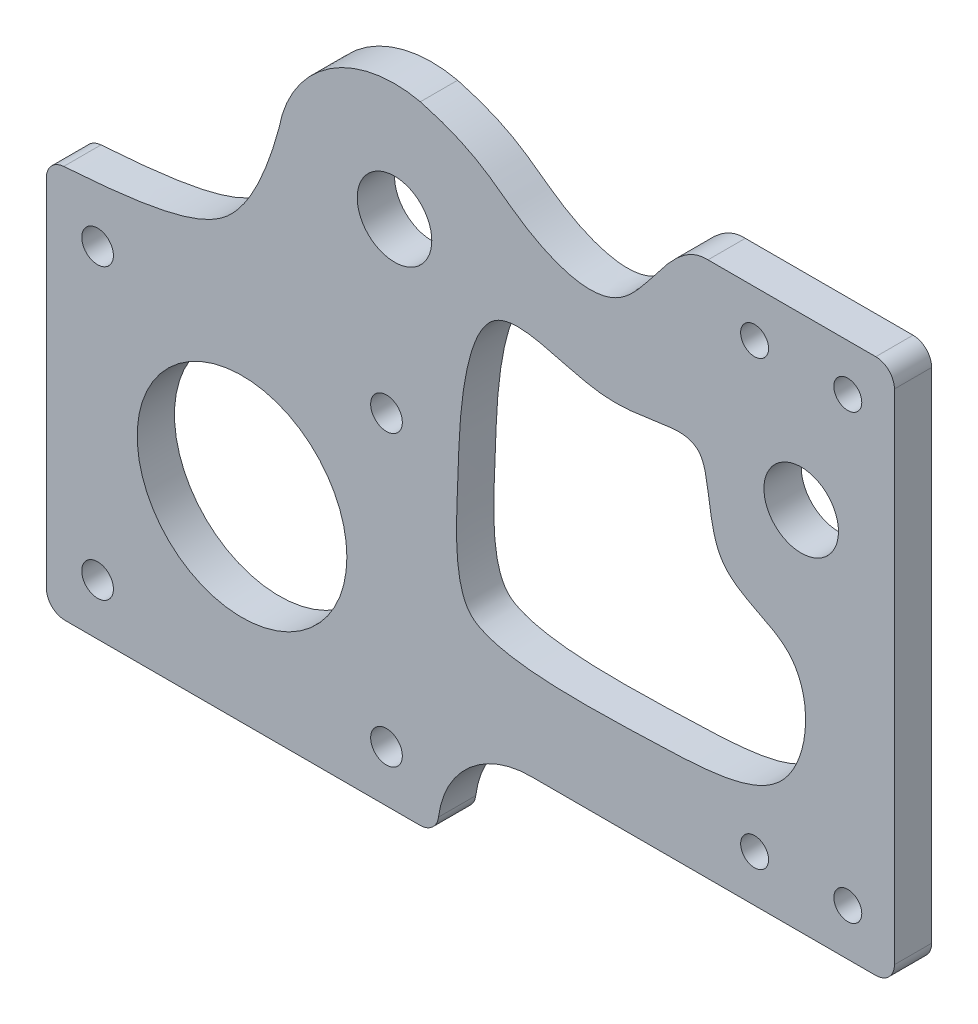
ISO-10303-21;
HEADER;
FILE_DESCRIPTION(('STEP AP214'),'2;1');
FILE_NAME('part.step','',(''),(''),'','','');
FILE_SCHEMA(('AUTOMOTIVE_DESIGN { 1 0 10303 214 1 1 1 1 }'));
ENDSEC;
DATA;
#1=APPLICATION_CONTEXT('core data for automotive mechanical design processes');
#2=APPLICATION_PROTOCOL_DEFINITION('international standard','automotive_design',2000,#1);
#3=PRODUCT_CONTEXT('',#1,'mechanical');
#4=PRODUCT('Part','Part','',(#3));
#5=PRODUCT_RELATED_PRODUCT_CATEGORY('part','',(#4));
#6=PRODUCT_DEFINITION_FORMATION('','',#4);
#7=PRODUCT_DEFINITION_CONTEXT('part definition',#1,'design');
#8=PRODUCT_DEFINITION('design','',#6,#7);
#9=PRODUCT_DEFINITION_SHAPE('','',#8);
#10=(LENGTH_UNIT() NAMED_UNIT(*) SI_UNIT(.MILLI.,.METRE.));
#11=(NAMED_UNIT(*) PLANE_ANGLE_UNIT() SI_UNIT($,.RADIAN.));
#12=(NAMED_UNIT(*) SI_UNIT($,.STERADIAN.) SOLID_ANGLE_UNIT());
#13=UNCERTAINTY_MEASURE_WITH_UNIT(LENGTH_MEASURE(1.E-05),#10,'distance_accuracy_value','');
#14=(GEOMETRIC_REPRESENTATION_CONTEXT(3) GLOBAL_UNCERTAINTY_ASSIGNED_CONTEXT((#13)) GLOBAL_UNIT_ASSIGNED_CONTEXT((#10,
#11,#12)) REPRESENTATION_CONTEXT('',''));
#15=CARTESIAN_POINT('',(0.,0.,0.));
#16=DIRECTION('',(0.,0.,1.));
#17=DIRECTION('',(1.,0.,0.));
#18=AXIS2_PLACEMENT_3D('',#15,#16,#17);
#19=CARTESIAN_POINT('',(-81.,0.,4.));
#20=DIRECTION('',(-1.,0.,0.));
#21=DIRECTION('',(0.,0.,1.));
#22=AXIS2_PLACEMENT_3D('',#19,#20,#21);
#23=PLANE('',#22);
#24=DIRECTION('',(0.,1.,0.));
#25=VECTOR('',#24,1.);
#26=CARTESIAN_POINT('',(-81.,0.,4.));
#27=LINE('',#26,#25);
#28=CARTESIAN_POINT('',(-81.,-47.75,4.));
#29=VERTEX_POINT('',#28);
#30=CARTESIAN_POINT('',(-81.,-9.62963183008872,4.));
#31=VERTEX_POINT('',#30);
#32=EDGE_CURVE('E372',#29,#31,#27,.T.);
#33=ORIENTED_EDGE('',*,*,#32,.T.);
#34=DIRECTION('',(0.,0.,-1.));
#35=VECTOR('',#34,1.);
#36=CARTESIAN_POINT('',(-81.,-9.62963183008872,4.));
#37=LINE('',#36,#35);
#38=CARTESIAN_POINT('',(-81.,-9.62963183008872,0.));
#39=VERTEX_POINT('',#38);
#40=EDGE_CURVE('E267',#31,#39,#37,.T.);
#41=ORIENTED_EDGE('',*,*,#40,.T.);
#42=DIRECTION('',(0.,1.,0.));
#43=VECTOR('',#42,1.);
#44=CARTESIAN_POINT('',(-81.,0.,0.));
#45=LINE('',#44,#43);
#46=CARTESIAN_POINT('',(-81.,-47.75,0.));
#47=VERTEX_POINT('',#46);
#48=EDGE_CURVE('E287',#47,#39,#45,.T.);
#49=ORIENTED_EDGE('',*,*,#48,.F.);
#50=DIRECTION('',(0.,0.,-1.));
#51=VECTOR('',#50,1.);
#52=CARTESIAN_POINT('',(-81.,-47.75,4.));
#53=LINE('',#52,#51);
#54=EDGE_CURVE('E265',#47,#29,#53,.F.);
#55=ORIENTED_EDGE('',*,*,#54,.T.);
#56=EDGE_LOOP('',(#33,#41,#49,#55));
#57=FACE_BOUND('',#56,.T.);
#58=ADVANCED_FACE('F34',(#57),#23,.T.);
#59=CARTESIAN_POINT('',(0.,-49.75,4.));
#60=DIRECTION('',(0.,-1.,0.));
#61=DIRECTION('',(1.,0.,0.));
#62=AXIS2_PLACEMENT_3D('',#59,#60,#61);
#63=PLANE('',#62);
#64=DIRECTION('',(-1.,0.,0.));
#65=VECTOR('',#64,1.);
#66=CARTESIAN_POINT('',(0.,-49.75,0.));
#67=LINE('',#66,#65);
#68=CARTESIAN_POINT('',(-40.9058808997906,-49.75,0.));
#69=VERTEX_POINT('',#68);
#70=CARTESIAN_POINT('',(-79.,-49.75,0.));
#71=VERTEX_POINT('',#70);
#72=EDGE_CURVE('E276',#69,#71,#67,.T.);
#73=ORIENTED_EDGE('',*,*,#72,.F.);
#74=DIRECTION('',(0.,0.,-1.));
#75=VECTOR('',#74,1.);
#76=CARTESIAN_POINT('',(-40.9058808997906,-49.75,4.));
#77=LINE('',#76,#75);
#78=CARTESIAN_POINT('',(-40.9058808997906,-49.75,4.));
#79=VERTEX_POINT('',#78);
#80=EDGE_CURVE('E11',#69,#79,#77,.F.);
#81=ORIENTED_EDGE('',*,*,#80,.T.);
#82=DIRECTION('',(-1.,0.,0.));
#83=VECTOR('',#82,1.);
#84=CARTESIAN_POINT('',(0.,-49.75,4.));
#85=LINE('',#84,#83);
#86=CARTESIAN_POINT('',(-79.,-49.75,4.));
#87=VERTEX_POINT('',#86);
#88=EDGE_CURVE('E277',#79,#87,#85,.T.);
#89=ORIENTED_EDGE('',*,*,#88,.T.);
#90=DIRECTION('',(0.,0.,-1.));
#91=VECTOR('',#90,1.);
#92=CARTESIAN_POINT('',(-79.,-49.75,4.));
#93=LINE('',#92,#91);
#94=EDGE_CURVE('E42',#87,#71,#93,.T.);
#95=ORIENTED_EDGE('',*,*,#94,.T.);
#96=EDGE_LOOP('',(#73,#81,#89,#95));
#97=FACE_BOUND('',#96,.T.);
#98=ADVANCED_FACE('F192',(#97),#63,.T.);
#99=CARTESIAN_POINT('',(0.,-39.25,4.));
#100=DIRECTION('',(0.,1.,0.));
#101=DIRECTION('',(0.,0.,1.));
#102=AXIS2_PLACEMENT_3D('',#99,#100,#101);
#103=PLANE('',#102);
#104=DIRECTION('',(1.,0.,0.));
#105=VECTOR('',#104,1.);
#106=CARTESIAN_POINT('',(0.,-39.25,0.));
#107=LINE('',#106,#105);
#108=CARTESIAN_POINT('',(-29.,-39.25,0.));
#109=VERTEX_POINT('',#108);
#110=CARTESIAN_POINT('',(8.,-39.25,0.));
#111=VERTEX_POINT('',#110);
#112=EDGE_CURVE('E286',#109,#111,#107,.T.);
#113=ORIENTED_EDGE('',*,*,#112,.T.);
#114=DIRECTION('',(0.,0.,-1.));
#115=VECTOR('',#114,1.);
#116=CARTESIAN_POINT('',(8.,-39.25,4.));
#117=LINE('',#116,#115);
#118=CARTESIAN_POINT('',(8.,-39.25,4.));
#119=VERTEX_POINT('',#118);
#120=EDGE_CURVE('E57',#111,#119,#117,.F.);
#121=ORIENTED_EDGE('',*,*,#120,.T.);
#122=DIRECTION('',(1.,0.,0.));
#123=VECTOR('',#122,1.);
#124=CARTESIAN_POINT('',(0.,-39.25,4.));
#125=LINE('',#124,#123);
#126=CARTESIAN_POINT('',(-29.,-39.25,4.));
#127=VERTEX_POINT('',#126);
#128=EDGE_CURVE('E362',#127,#119,#125,.T.);
#129=ORIENTED_EDGE('',*,*,#128,.F.);
#130=DIRECTION('',(0.,0.,-1.));
#131=VECTOR('',#130,1.);
#132=CARTESIAN_POINT('',(-29.,-39.25,0.));
#133=LINE('',#132,#131);
#134=EDGE_CURVE('E160',#127,#109,#133,.T.);
#135=ORIENTED_EDGE('',*,*,#134,.T.);
#136=EDGE_LOOP('',(#113,#121,#129,#135));
#137=FACE_BOUND('',#136,.T.);
#138=ADVANCED_FACE('F188',(#137),#103,.F.);
#139=CARTESIAN_POINT('',(10.,0.,4.));
#140=DIRECTION('',(-1.,0.,0.));
#141=DIRECTION('',(0.,-1.,0.));
#142=AXIS2_PLACEMENT_3D('',#139,#140,#141);
#143=PLANE('',#142);
#144=DIRECTION('',(0.,1.,0.));
#145=VECTOR('',#144,1.);
#146=CARTESIAN_POINT('',(10.,0.,0.));
#147=LINE('',#146,#145);
#148=CARTESIAN_POINT('',(10.,-37.25,0.));
#149=VERTEX_POINT('',#148);
#150=CARTESIAN_POINT('',(10.,16.25,0.));
#151=VERTEX_POINT('',#150);
#152=EDGE_CURVE('E289',#149,#151,#147,.T.);
#153=ORIENTED_EDGE('',*,*,#152,.T.);
#154=DIRECTION('',(0.,0.,-1.));
#155=VECTOR('',#154,1.);
#156=CARTESIAN_POINT('',(10.,16.25,4.));
#157=LINE('',#156,#155);
#158=CARTESIAN_POINT('',(10.,16.25,4.));
#159=VERTEX_POINT('',#158);
#160=EDGE_CURVE('E258',#151,#159,#157,.F.);
#161=ORIENTED_EDGE('',*,*,#160,.T.);
#162=DIRECTION('',(0.,1.,0.));
#163=VECTOR('',#162,1.);
#164=CARTESIAN_POINT('',(10.,0.,4.));
#165=LINE('',#164,#163);
#166=CARTESIAN_POINT('',(10.,-37.25,4.));
#167=VERTEX_POINT('',#166);
#168=EDGE_CURVE('E150',#167,#159,#165,.T.);
#169=ORIENTED_EDGE('',*,*,#168,.F.);
#170=DIRECTION('',(0.,0.,-1.));
#171=VECTOR('',#170,1.);
#172=CARTESIAN_POINT('',(10.,-37.25,4.));
#173=LINE('',#172,#171);
#174=EDGE_CURVE('E355',#167,#149,#173,.T.);
#175=ORIENTED_EDGE('',*,*,#174,.T.);
#176=EDGE_LOOP('',(#153,#161,#169,#175));
#177=FACE_BOUND('',#176,.T.);
#178=ADVANCED_FACE('F185',(#177),#143,.F.);
#179=CARTESIAN_POINT('',(0.,18.25,4.));
#180=DIRECTION('',(0.,-1.,0.));
#181=DIRECTION('',(1.,0.,0.));
#182=AXIS2_PLACEMENT_3D('',#179,#180,#181);
#183=PLANE('',#182);
#184=DIRECTION('',(-1.,0.,0.));
#185=VECTOR('',#184,1.);
#186=CARTESIAN_POINT('',(0.,18.25,4.));
#187=LINE('',#186,#185);
#188=CARTESIAN_POINT('',(8.00000000000001,18.25,4.));
#189=VERTEX_POINT('',#188);
#190=CARTESIAN_POINT('',(-10.,18.25,4.));
#191=VERTEX_POINT('',#190);
#192=EDGE_CURVE('E137',#189,#191,#187,.T.);
#193=ORIENTED_EDGE('',*,*,#192,.F.);
#194=DIRECTION('',(0.,0.,-1.));
#195=VECTOR('',#194,1.);
#196=CARTESIAN_POINT('',(8.00000000000001,18.25,4.));
#197=LINE('',#196,#195);
#198=CARTESIAN_POINT('',(8.00000000000001,18.25,0.));
#199=VERTEX_POINT('',#198);
#200=EDGE_CURVE('E345',#189,#199,#197,.T.);
#201=ORIENTED_EDGE('',*,*,#200,.T.);
#202=DIRECTION('',(-1.,0.,0.));
#203=VECTOR('',#202,1.);
#204=CARTESIAN_POINT('',(0.,18.25,0.));
#205=LINE('',#204,#203);
#206=CARTESIAN_POINT('',(-10.,18.25,0.));
#207=VERTEX_POINT('',#206);
#208=EDGE_CURVE('E156',#199,#207,#205,.T.);
#209=ORIENTED_EDGE('',*,*,#208,.T.);
#210=DIRECTION('',(0.,0.,-1.));
#211=VECTOR('',#210,1.);
#212=CARTESIAN_POINT('',(-10.,18.25,4.));
#213=LINE('',#212,#211);
#214=EDGE_CURVE('E153',#191,#207,#213,.T.);
#215=ORIENTED_EDGE('',*,*,#214,.F.);
#216=EDGE_LOOP('',(#193,#201,#209,#215));
#217=FACE_BOUND('',#216,.T.);
#218=ADVANCED_FACE('F154',(#217),#183,.F.);
#219=CARTESIAN_POINT('',(-40.8666973015996,17.5061584392273,4.));
#220=CARTESIAN_POINT('',(-34.6739339786931,15.8351004506378,4.));
#221=CARTESIAN_POINT('',(-31.1483072192313,11.5626537263526,4.));
#222=CARTESIAN_POINT('',(-18.0783503978575,6.16680142039194,4.));
#223=CARTESIAN_POINT('',(-13.9696513686013,18.3912265680418,4.));
#224=CARTESIAN_POINT('',(-10.,18.25,4.));
#225=B_SPLINE_CURVE_WITH_KNOTS('',3,(#219,#220,#221,#222,#223,#224),.UNSPECIFIED.,.F.,.F.,(4,1,
1,4),(0.,0.320221628085396,0.646274515701762,1.),.UNSPECIFIED.);
#226=DIRECTION('',(0.,0.,-1.));
#227=VECTOR('',#226,1.);
#228=SURFACE_OF_LINEAR_EXTRUSION('',#225,#227);
#229=CARTESIAN_POINT('',(-40.8666973015996,17.5061584392273,0.));
#230=CARTESIAN_POINT('',(-34.6739339786931,15.8351004506378,0.));
#231=CARTESIAN_POINT('',(-31.1483072192313,11.5626537263526,0.));
#232=CARTESIAN_POINT('',(-18.0783503978575,6.16680142039194,0.));
#233=CARTESIAN_POINT('',(-13.9696513686013,18.3912265680418,0.));
#234=CARTESIAN_POINT('',(-10.,18.25,0.));
#235=B_SPLINE_CURVE_WITH_KNOTS('',3,(#229,#230,#231,#232,#233,#234),.UNSPECIFIED.,.F.,.F.,(4,1,
1,4),(0.,0.320221628085396,0.646274515701762,1.),.UNSPECIFIED.);
#236=CARTESIAN_POINT('',(-40.8666973015996,17.5061584392273,0.));
#237=VERTEX_POINT('',#236);
#238=EDGE_CURVE('E298',#237,#207,#235,.T.);
#239=ORIENTED_EDGE('',*,*,#238,.F.);
#240=DIRECTION('',(0.,0.,-1.));
#241=VECTOR('',#240,1.);
#242=CARTESIAN_POINT('',(-40.8666973015996,17.5061584392273,4.));
#243=LINE('',#242,#241);
#244=CARTESIAN_POINT('',(-40.8666973015996,17.5061584392273,4.));
#245=VERTEX_POINT('',#244);
#246=EDGE_CURVE('E161',#245,#237,#243,.T.);
#247=ORIENTED_EDGE('',*,*,#246,.F.);
#248=EDGE_CURVE('E144',#245,#191,#225,.T.);
#249=ORIENTED_EDGE('',*,*,#248,.T.);
#250=ORIENTED_EDGE('',*,*,#214,.T.);
#251=EDGE_LOOP('',(#239,#247,#249,#250));
#252=FACE_BOUND('',#251,.T.);
#253=ADVANCED_FACE('F163',(#252),#228,.T.);
#254=CARTESIAN_POINT('',(-43.6394987277847,5.21504082320294,4.));
#255=DIRECTION('',(0.,0.,-1.));
#256=DIRECTION('',(-1.,0.,0.));
#257=AXIS2_PLACEMENT_3D('',#254,#255,#256);
#258=CYLINDRICAL_SURFACE('',#257,12.6);
#259=CARTESIAN_POINT('',(-43.6394987277847,5.21504082320294,0.));
#260=DIRECTION('',(0.,0.,1.));
#261=DIRECTION('',(1.,0.,0.));
#262=AXIS2_PLACEMENT_3D('',#259,#260,#261);
#263=CIRCLE('',#262,12.6);
#264=CARTESIAN_POINT('',(-56.0334046844792,7.48464324138385,0.));
#265=VERTEX_POINT('',#264);
#266=EDGE_CURVE('E302',#237,#265,#263,.T.);
#267=ORIENTED_EDGE('',*,*,#266,.T.);
#268=DIRECTION('',(0.,0.,-1.));
#269=VECTOR('',#268,1.);
#270=CARTESIAN_POINT('',(-56.0334046844792,7.48464324138385,4.));
#271=LINE('',#270,#269);
#272=CARTESIAN_POINT('',(-56.0334046844792,7.48464324138385,4.));
#273=VERTEX_POINT('',#272);
#274=EDGE_CURVE('E334',#273,#265,#271,.T.);
#275=ORIENTED_EDGE('',*,*,#274,.F.);
#276=CARTESIAN_POINT('',(-43.6394987277847,5.21504082320294,4.));
#277=DIRECTION('',(0.,0.,1.));
#278=DIRECTION('',(1.,0.,0.));
#279=AXIS2_PLACEMENT_3D('',#276,#277,#278);
#280=CIRCLE('',#279,12.6);
#281=EDGE_CURVE('E165',#245,#273,#280,.T.);
#282=ORIENTED_EDGE('',*,*,#281,.F.);
#283=ORIENTED_EDGE('',*,*,#246,.T.);
#284=EDGE_LOOP('',(#267,#275,#282,#283));
#285=FACE_BOUND('',#284,.T.);
#286=ADVANCED_FACE('F181',(#285),#258,.T.);
#287=CARTESIAN_POINT('',(0.,0.,4.));
#288=DIRECTION('',(0.,0.,-1.));
#289=DIRECTION('',(-1.,0.,0.));
#290=AXIS2_PLACEMENT_3D('',#287,#288,#289);
#291=CYLINDRICAL_SURFACE('',#290,4.);
#292=CARTESIAN_POINT('',(0.,0.,4.));
#293=DIRECTION('',(0.,0.,1.));
#294=DIRECTION('',(1.,0.,0.));
#295=AXIS2_PLACEMENT_3D('',#292,#293,#294);
#296=CIRCLE('',#295,4.);
#297=CARTESIAN_POINT('',(4.,0.,4.));
#298=VERTEX_POINT('',#297);
#299=EDGE_CURVE('E400',#298,#298,#296,.T.);
#300=ORIENTED_EDGE('',*,*,#299,.T.);
#301=EDGE_LOOP('',(#300));
#302=FACE_BOUND('',#301,.T.);
#303=CARTESIAN_POINT('',(0.,0.,0.));
#304=DIRECTION('',(0.,0.,1.));
#305=DIRECTION('',(1.,0.,0.));
#306=AXIS2_PLACEMENT_3D('',#303,#304,#305);
#307=CIRCLE('',#306,4.);
#308=CARTESIAN_POINT('',(4.,0.,0.));
#309=VERTEX_POINT('',#308);
#310=EDGE_CURVE('E327',#309,#309,#307,.T.);
#311=ORIENTED_EDGE('',*,*,#310,.F.);
#312=EDGE_LOOP('',(#311));
#313=FACE_BOUND('',#312,.T.);
#314=ADVANCED_FACE('F436',(#302,#313),#291,.F.);
#315=CARTESIAN_POINT('',(-5.,13.25,4.));
#316=DIRECTION('',(0.,0.,-1.));
#317=DIRECTION('',(-1.,0.,0.));
#318=AXIS2_PLACEMENT_3D('',#315,#316,#317);
#319=CYLINDRICAL_SURFACE('',#318,1.5);
#320=CARTESIAN_POINT('',(-5.,13.25,4.));
#321=DIRECTION('',(0.,0.,1.));
#322=DIRECTION('',(1.,0.,0.));
#323=AXIS2_PLACEMENT_3D('',#320,#321,#322);
#324=CIRCLE('',#323,1.5);
#325=CARTESIAN_POINT('',(-3.5,13.25,4.));
#326=VERTEX_POINT('',#325);
#327=EDGE_CURVE('E397',#326,#326,#324,.T.);
#328=ORIENTED_EDGE('',*,*,#327,.T.);
#329=EDGE_LOOP('',(#328));
#330=FACE_BOUND('',#329,.T.);
#331=CARTESIAN_POINT('',(-5.,13.25,0.));
#332=DIRECTION('',(0.,0.,1.));
#333=DIRECTION('',(1.,0.,0.));
#334=AXIS2_PLACEMENT_3D('',#331,#332,#333);
#335=CIRCLE('',#334,1.5);
#336=CARTESIAN_POINT('',(-3.5,13.25,0.));
#337=VERTEX_POINT('',#336);
#338=EDGE_CURVE('E324',#337,#337,#335,.T.);
#339=ORIENTED_EDGE('',*,*,#338,.F.);
#340=EDGE_LOOP('',(#339));
#341=FACE_BOUND('',#340,.T.);
#342=ADVANCED_FACE('F439',(#330,#341),#319,.F.);
#343=CARTESIAN_POINT('',(5.,13.25,4.));
#344=DIRECTION('',(0.,0.,-1.));
#345=DIRECTION('',(-1.,0.,0.));
#346=AXIS2_PLACEMENT_3D('',#343,#344,#345);
#347=CYLINDRICAL_SURFACE('',#346,1.5);
#348=CARTESIAN_POINT('',(5.,13.25,4.));
#349=DIRECTION('',(0.,0.,1.));
#350=DIRECTION('',(1.,0.,0.));
#351=AXIS2_PLACEMENT_3D('',#348,#349,#350);
#352=CIRCLE('',#351,1.5);
#353=CARTESIAN_POINT('',(6.5,13.25,4.));
#354=VERTEX_POINT('',#353);
#355=EDGE_CURVE('E394',#354,#354,#352,.T.);
#356=ORIENTED_EDGE('',*,*,#355,.T.);
#357=EDGE_LOOP('',(#356));
#358=FACE_BOUND('',#357,.T.);
#359=CARTESIAN_POINT('',(5.,13.25,0.));
#360=DIRECTION('',(0.,0.,1.));
#361=DIRECTION('',(1.,0.,0.));
#362=AXIS2_PLACEMENT_3D('',#359,#360,#361);
#363=CIRCLE('',#362,1.5);
#364=CARTESIAN_POINT('',(6.5,13.25,0.));
#365=VERTEX_POINT('',#364);
#366=EDGE_CURVE('E321',#365,#365,#363,.T.);
#367=ORIENTED_EDGE('',*,*,#366,.F.);
#368=EDGE_LOOP('',(#367));
#369=FACE_BOUND('',#368,.T.);
#370=ADVANCED_FACE('F443',(#358,#369),#347,.F.);
#371=CARTESIAN_POINT('',(5.00000000000001,-34.25,4.));
#372=DIRECTION('',(0.,0.,-1.));
#373=DIRECTION('',(-1.,0.,0.));
#374=AXIS2_PLACEMENT_3D('',#371,#372,#373);
#375=CYLINDRICAL_SURFACE('',#374,1.5);
#376=CARTESIAN_POINT('',(5.00000000000001,-34.25,4.));
#377=DIRECTION('',(0.,0.,1.));
#378=DIRECTION('',(1.,0.,0.));
#379=AXIS2_PLACEMENT_3D('',#376,#377,#378);
#380=CIRCLE('',#379,1.5);
#381=CARTESIAN_POINT('',(6.50000000000001,-34.25,4.));
#382=VERTEX_POINT('',#381);
#383=EDGE_CURVE('E391',#382,#382,#380,.T.);
#384=ORIENTED_EDGE('',*,*,#383,.T.);
#385=EDGE_LOOP('',(#384));
#386=FACE_BOUND('',#385,.T.);
#387=CARTESIAN_POINT('',(5.00000000000001,-34.25,0.));
#388=DIRECTION('',(0.,0.,1.));
#389=DIRECTION('',(1.,0.,0.));
#390=AXIS2_PLACEMENT_3D('',#387,#388,#389);
#391=CIRCLE('',#390,1.5);
#392=CARTESIAN_POINT('',(6.50000000000001,-34.25,0.));
#393=VERTEX_POINT('',#392);
#394=EDGE_CURVE('E318',#393,#393,#391,.T.);
#395=ORIENTED_EDGE('',*,*,#394,.F.);
#396=EDGE_LOOP('',(#395));
#397=FACE_BOUND('',#396,.T.);
#398=ADVANCED_FACE('F378',(#386,#397),#375,.F.);
#399=CARTESIAN_POINT('',(-4.99999999999999,-34.25,4.));
#400=DIRECTION('',(0.,0.,-1.));
#401=DIRECTION('',(-1.,0.,0.));
#402=AXIS2_PLACEMENT_3D('',#399,#400,#401);
#403=CYLINDRICAL_SURFACE('',#402,1.5);
#404=CARTESIAN_POINT('',(-4.99999999999999,-34.25,4.));
#405=DIRECTION('',(0.,0.,1.));
#406=DIRECTION('',(1.,0.,0.));
#407=AXIS2_PLACEMENT_3D('',#404,#405,#406);
#408=CIRCLE('',#407,1.5);
#409=CARTESIAN_POINT('',(-3.49999999999999,-34.25,4.));
#410=VERTEX_POINT('',#409);
#411=EDGE_CURVE('E369',#410,#410,#408,.T.);
#412=ORIENTED_EDGE('',*,*,#411,.T.);
#413=EDGE_LOOP('',(#412));
#414=FACE_BOUND('',#413,.T.);
#415=CARTESIAN_POINT('',(-4.99999999999999,-34.25,0.));
#416=DIRECTION('',(0.,0.,1.));
#417=DIRECTION('',(1.,0.,0.));
#418=AXIS2_PLACEMENT_3D('',#415,#416,#417);
#419=CIRCLE('',#418,1.5);
#420=CARTESIAN_POINT('',(-3.49999999999999,-34.25,0.));
#421=VERTEX_POINT('',#420);
#422=EDGE_CURVE('E312',#421,#421,#419,.T.);
#423=ORIENTED_EDGE('',*,*,#422,.F.);
#424=EDGE_LOOP('',(#423));
#425=FACE_BOUND('',#424,.T.);
#426=ADVANCED_FACE('F374',(#414,#425),#403,.F.);
#427=CARTESIAN_POINT('',(-81.,-7.75000000000001,4.));
#428=CARTESIAN_POINT('',(-71.2883550301785,-7.18986029064884,4.));
#429=CARTESIAN_POINT('',(-65.2187368549798,-6.07286439049438,4.));
#430=CARTESIAN_POINT('',(-59.2531744628276,-1.95963354215156,4.));
#431=CARTESIAN_POINT('',(-57.1406920461794,3.34461669581095,4.));
#432=CARTESIAN_POINT('',(-56.0334046844792,7.48464324138385,4.));
#433=B_SPLINE_CURVE_WITH_KNOTS('',3,(#427,#428,#429,#430,#431,#432),.UNSPECIFIED.,.F.,.F.,(4,1,
1,4),(0.,0.434692380225144,0.534692380225144,1.),.UNSPECIFIED.);
#434=DIRECTION('',(0.,0.,-1.));
#435=VECTOR('',#434,1.);
#436=SURFACE_OF_LINEAR_EXTRUSION('',#433,#435);
#437=CARTESIAN_POINT('',(-81.,-7.75000000000001,0.));
#438=CARTESIAN_POINT('',(-71.2883550301785,-7.18986029064884,0.));
#439=CARTESIAN_POINT('',(-65.2187368549798,-6.07286439049438,0.));
#440=CARTESIAN_POINT('',(-59.2531744628276,-1.95963354215156,0.));
#441=CARTESIAN_POINT('',(-57.1406920461794,3.34461669581095,0.));
#442=CARTESIAN_POINT('',(-56.0334046844792,7.48464324138385,0.));
#443=B_SPLINE_CURVE_WITH_KNOTS('',3,(#437,#438,#439,#440,#441,#442),.UNSPECIFIED.,.F.,.F.,(4,1,
1,4),(0.,0.434692380225144,0.534692380225144,1.),.UNSPECIFIED.);
#444=CARTESIAN_POINT('',(-79.1334082473049,-7.63408623062198,0.));
#445=VERTEX_POINT('',#444);
#446=EDGE_CURVE('E308',#445,#265,#443,.T.);
#447=ORIENTED_EDGE('',*,*,#446,.F.);
#448=DIRECTION('',(0.,0.,-1.));
#449=VECTOR('',#448,1.);
#450=CARTESIAN_POINT('',(-79.1334082473049,-7.63408623062198,0.));
#451=LINE('',#450,#449);
#452=CARTESIAN_POINT('',(-79.1334082473048,-7.63408623062198,4.));
#453=VERTEX_POINT('',#452);
#454=EDGE_CURVE('E49',#445,#453,#451,.F.);
#455=ORIENTED_EDGE('',*,*,#454,.T.);
#456=EDGE_CURVE('E167',#453,#273,#433,.T.);
#457=ORIENTED_EDGE('',*,*,#456,.T.);
#458=ORIENTED_EDGE('',*,*,#274,.T.);
#459=EDGE_LOOP('',(#447,#455,#457,#458));
#460=FACE_BOUND('',#459,.T.);
#461=ADVANCED_FACE('F203',(#460),#436,.T.);
#462=CARTESIAN_POINT('',(-75.5,-13.25,4.));
#463=DIRECTION('',(0.,0.,-1.));
#464=DIRECTION('',(-1.,0.,0.));
#465=AXIS2_PLACEMENT_3D('',#462,#463,#464);
#466=CYLINDRICAL_SURFACE('',#465,1.7);
#467=CARTESIAN_POINT('',(-75.5,-13.25,4.));
#468=DIRECTION('',(0.,0.,1.));
#469=DIRECTION('',(1.,0.,0.));
#470=AXIS2_PLACEMENT_3D('',#467,#468,#469);
#471=CIRCLE('',#470,1.7);
#472=CARTESIAN_POINT('',(-73.8,-13.25,4.));
#473=VERTEX_POINT('',#472);
#474=EDGE_CURVE('E643',#473,#473,#471,.T.);
#475=ORIENTED_EDGE('',*,*,#474,.T.);
#476=EDGE_LOOP('',(#475));
#477=FACE_BOUND('',#476,.T.);
#478=CARTESIAN_POINT('',(-75.5,-13.25,0.));
#479=DIRECTION('',(0.,0.,1.));
#480=DIRECTION('',(1.,0.,0.));
#481=AXIS2_PLACEMENT_3D('',#478,#479,#480);
#482=CIRCLE('',#481,1.7);
#483=CARTESIAN_POINT('',(-73.8,-13.25,0.));
#484=VERTEX_POINT('',#483);
#485=EDGE_CURVE('E291',#484,#484,#482,.T.);
#486=ORIENTED_EDGE('',*,*,#485,.F.);
#487=EDGE_LOOP('',(#486));
#488=FACE_BOUND('',#487,.T.);
#489=ADVANCED_FACE('F199',(#477,#488),#466,.F.);
#490=CARTESIAN_POINT('',(-75.5,-44.25,4.));
#491=DIRECTION('',(0.,0.,-1.));
#492=DIRECTION('',(-1.,0.,0.));
#493=AXIS2_PLACEMENT_3D('',#490,#491,#492);
#494=CYLINDRICAL_SURFACE('',#493,1.7);
#495=CARTESIAN_POINT('',(-75.5,-44.25,4.));
#496=DIRECTION('',(0.,0.,1.));
#497=DIRECTION('',(1.,0.,0.));
#498=AXIS2_PLACEMENT_3D('',#495,#496,#497);
#499=CIRCLE('',#498,1.7);
#500=CARTESIAN_POINT('',(-73.8,-44.25,4.));
#501=VERTEX_POINT('',#500);
#502=EDGE_CURVE('E640',#501,#501,#499,.T.);
#503=ORIENTED_EDGE('',*,*,#502,.T.);
#504=EDGE_LOOP('',(#503));
#505=FACE_BOUND('',#504,.T.);
#506=CARTESIAN_POINT('',(-75.5,-44.25,0.));
#507=DIRECTION('',(0.,0.,1.));
#508=DIRECTION('',(1.,0.,0.));
#509=AXIS2_PLACEMENT_3D('',#506,#507,#508);
#510=CIRCLE('',#509,1.7);
#511=CARTESIAN_POINT('',(-73.8,-44.25,0.));
#512=VERTEX_POINT('',#511);
#513=EDGE_CURVE('E415',#512,#512,#510,.T.);
#514=ORIENTED_EDGE('',*,*,#513,.F.);
#515=EDGE_LOOP('',(#514));
#516=FACE_BOUND('',#515,.T.);
#517=ADVANCED_FACE('F202',(#505,#516),#494,.F.);
#518=CARTESIAN_POINT('',(-44.5,-44.25,4.));
#519=DIRECTION('',(0.,0.,-1.));
#520=DIRECTION('',(-1.,0.,0.));
#521=AXIS2_PLACEMENT_3D('',#518,#519,#520);
#522=CYLINDRICAL_SURFACE('',#521,1.7);
#523=CARTESIAN_POINT('',(-44.5,-44.25,4.));
#524=DIRECTION('',(0.,0.,1.));
#525=DIRECTION('',(1.,0.,0.));
#526=AXIS2_PLACEMENT_3D('',#523,#524,#525);
#527=CIRCLE('',#526,1.7);
#528=CARTESIAN_POINT('',(-42.8,-44.25,4.));
#529=VERTEX_POINT('',#528);
#530=EDGE_CURVE('E637',#529,#529,#527,.T.);
#531=ORIENTED_EDGE('',*,*,#530,.T.);
#532=EDGE_LOOP('',(#531));
#533=FACE_BOUND('',#532,.T.);
#534=CARTESIAN_POINT('',(-44.5,-44.25,0.));
#535=DIRECTION('',(0.,0.,1.));
#536=DIRECTION('',(1.,0.,0.));
#537=AXIS2_PLACEMENT_3D('',#534,#535,#536);
#538=CIRCLE('',#537,1.7);
#539=CARTESIAN_POINT('',(-42.8,-44.25,0.));
#540=VERTEX_POINT('',#539);
#541=EDGE_CURVE('E412',#540,#540,#538,.T.);
#542=ORIENTED_EDGE('',*,*,#541,.F.);
#543=EDGE_LOOP('',(#542));
#544=FACE_BOUND('',#543,.T.);
#545=ADVANCED_FACE('F207',(#533,#544),#522,.F.);
#546=CARTESIAN_POINT('',(-44.5,-13.25,4.));
#547=DIRECTION('',(0.,0.,-1.));
#548=DIRECTION('',(-1.,0.,0.));
#549=AXIS2_PLACEMENT_3D('',#546,#547,#548);
#550=CYLINDRICAL_SURFACE('',#549,1.7);
#551=CARTESIAN_POINT('',(-44.5,-13.25,4.));
#552=DIRECTION('',(0.,0.,1.));
#553=DIRECTION('',(1.,0.,0.));
#554=AXIS2_PLACEMENT_3D('',#551,#552,#553);
#555=CIRCLE('',#554,1.7);
#556=CARTESIAN_POINT('',(-42.8,-13.25,4.));
#557=VERTEX_POINT('',#556);
#558=EDGE_CURVE('E634',#557,#557,#555,.T.);
#559=ORIENTED_EDGE('',*,*,#558,.T.);
#560=EDGE_LOOP('',(#559));
#561=FACE_BOUND('',#560,.T.);
#562=CARTESIAN_POINT('',(-44.5,-13.25,0.));
#563=DIRECTION('',(0.,0.,1.));
#564=DIRECTION('',(1.,0.,0.));
#565=AXIS2_PLACEMENT_3D('',#562,#563,#564);
#566=CIRCLE('',#565,1.7);
#567=CARTESIAN_POINT('',(-42.8,-13.25,0.));
#568=VERTEX_POINT('',#567);
#569=EDGE_CURVE('E408',#568,#568,#566,.T.);
#570=ORIENTED_EDGE('',*,*,#569,.F.);
#571=EDGE_LOOP('',(#570));
#572=FACE_BOUND('',#571,.T.);
#573=ADVANCED_FACE('F211',(#561,#572),#550,.F.);
#574=CARTESIAN_POINT('',(-60.,-28.75,4.));
#575=DIRECTION('',(0.,0.,-1.));
#576=DIRECTION('',(-1.,0.,0.));
#577=AXIS2_PLACEMENT_3D('',#574,#575,#576);
#578=CYLINDRICAL_SURFACE('',#577,11.25);
#579=CARTESIAN_POINT('',(-60.,-28.75,4.));
#580=DIRECTION('',(0.,0.,1.));
#581=DIRECTION('',(1.,0.,0.));
#582=AXIS2_PLACEMENT_3D('',#579,#580,#581);
#583=CIRCLE('',#582,11.25);
#584=CARTESIAN_POINT('',(-48.75,-28.75,4.));
#585=VERTEX_POINT('',#584);
#586=EDGE_CURVE('E333',#585,#585,#583,.T.);
#587=ORIENTED_EDGE('',*,*,#586,.T.);
#588=EDGE_LOOP('',(#587));
#589=FACE_BOUND('',#588,.T.);
#590=CARTESIAN_POINT('',(-60.,-28.75,0.));
#591=DIRECTION('',(0.,0.,1.));
#592=DIRECTION('',(1.,0.,0.));
#593=AXIS2_PLACEMENT_3D('',#590,#591,#592);
#594=CIRCLE('',#593,11.25);
#595=CARTESIAN_POINT('',(-48.75,-28.75,0.));
#596=VERTEX_POINT('',#595);
#597=EDGE_CURVE('E405',#596,#596,#594,.T.);
#598=ORIENTED_EDGE('',*,*,#597,.F.);
#599=EDGE_LOOP('',(#598));
#600=FACE_BOUND('',#599,.T.);
#601=ADVANCED_FACE('F215',(#589,#600),#578,.F.);
#602=CARTESIAN_POINT('',(-43.6394987277847,5.21504082320294,4.));
#603=DIRECTION('',(0.,0.,-1.));
#604=DIRECTION('',(-1.,0.,0.));
#605=AXIS2_PLACEMENT_3D('',#602,#603,#604);
#606=CYLINDRICAL_SURFACE('',#605,4.00000000000001);
#607=CARTESIAN_POINT('',(-43.6394987277847,5.21504082320294,4.));
#608=DIRECTION('',(0.,0.,1.));
#609=DIRECTION('',(1.,0.,0.));
#610=AXIS2_PLACEMENT_3D('',#607,#608,#609);
#611=CIRCLE('',#610,4.00000000000001);
#612=CARTESIAN_POINT('',(-39.6394987277847,5.21504082320294,4.));
#613=VERTEX_POINT('',#612);
#614=EDGE_CURVE('E337',#613,#613,#611,.T.);
#615=ORIENTED_EDGE('',*,*,#614,.T.);
#616=EDGE_LOOP('',(#615));
#617=FACE_BOUND('',#616,.T.);
#618=CARTESIAN_POINT('',(-43.6394987277847,5.21504082320294,0.));
#619=DIRECTION('',(0.,0.,1.));
#620=DIRECTION('',(1.,0.,0.));
#621=AXIS2_PLACEMENT_3D('',#618,#619,#620);
#622=CIRCLE('',#621,4.00000000000001);
#623=CARTESIAN_POINT('',(-39.6394987277847,5.21504082320294,0.));
#624=VERTEX_POINT('',#623);
#625=EDGE_CURVE('E330',#624,#624,#622,.T.);
#626=ORIENTED_EDGE('',*,*,#625,.F.);
#627=EDGE_LOOP('',(#626));
#628=FACE_BOUND('',#627,.T.);
#629=ADVANCED_FACE('F219',(#617,#628),#606,.F.);
#630=CARTESIAN_POINT('',(0.,0.,4.));
#631=DIRECTION('',(0.,0.,1.));
#632=DIRECTION('',(1.,0.,0.));
#633=AXIS2_PLACEMENT_3D('',#630,#631,#632);
#634=PLANE('',#633);
#635=CARTESIAN_POINT('',(-34.4449569953317,-28.1789230257736,4.));
#636=CARTESIAN_POINT('',(-30.9218920401082,-29.9628091009007,4.));
#637=CARTESIAN_POINT('',(-15.5060608242306,-29.5218056611563,4.));
#638=CARTESIAN_POINT('',(0.426240634644209,-28.9341004001703,4.));
#639=CARTESIAN_POINT('',(1.72395529381565,-12.3756439044255,4.));
#640=CARTESIAN_POINT('',(-10.3351372145526,-11.1175378219416,4.));
#641=CARTESIAN_POINT('',(-9.69215048831887,-1.15932353225414,4.));
#642=CARTESIAN_POINT('',(-12.562688670882,1.38470302371763,4.));
#643=CARTESIAN_POINT('',(-16.2081667855087,0.0489696862816859,4.));
#644=CARTESIAN_POINT('',(-24.577211571943,-0.106633827603668,4.));
#645=CARTESIAN_POINT('',(-34.8944471758883,5.71072229232318,4.));
#646=CARTESIAN_POINT('',(-36.6751226367253,-8.78031109096934,4.));
#647=CARTESIAN_POINT('',(-36.8541662638014,-17.7168425210242,4.));
#648=CARTESIAN_POINT('',(-37.5344712728886,-26.2489136755483,4.));
#649=CARTESIAN_POINT('',(-34.7915693190878,-28.0034176332604,4.));
#650=CARTESIAN_POINT('',(-34.4449569953317,-28.1789230257736,4.));
#651=B_SPLINE_CURVE_WITH_KNOTS('',3,(#635,#636,#637,#638,#639,#640,#641,#642,#643,#644,#645,
#646,#647,#648,#649,#650),.UNSPECIFIED.,.T.,.F.,(4,1,1,1,1,1,1,1,1,1,1,1,1,4),(0.,
0.116395905211152,0.228688234375523,0.343685307982383,0.433680773455668,0.513870417649734,
0.533562536659378,0.619819805008479,0.643369158059907,0.758273908630012,0.872764205470959,
0.896936814607957,0.988548534956439,1.),.UNSPECIFIED.);
#652=CARTESIAN_POINT('',(-34.4449569953317,-28.1789230257736,4.));
#653=VERTEX_POINT('',#652);
#654=EDGE_CURVE('E621',#653,#653,#651,.T.);
#655=ORIENTED_EDGE('',*,*,#654,.F.);
#656=EDGE_LOOP('',(#655));
#657=FACE_BOUND('',#656,.T.);
#658=ORIENTED_EDGE('',*,*,#586,.F.);
#659=EDGE_LOOP('',(#658));
#660=FACE_BOUND('',#659,.T.);
#661=ORIENTED_EDGE('',*,*,#558,.F.);
#662=EDGE_LOOP('',(#661));
#663=FACE_BOUND('',#662,.T.);
#664=ORIENTED_EDGE('',*,*,#530,.F.);
#665=EDGE_LOOP('',(#664));
#666=FACE_BOUND('',#665,.T.);
#667=ORIENTED_EDGE('',*,*,#502,.F.);
#668=EDGE_LOOP('',(#667));
#669=FACE_BOUND('',#668,.T.);
#670=ORIENTED_EDGE('',*,*,#474,.F.);
#671=EDGE_LOOP('',(#670));
#672=FACE_BOUND('',#671,.T.);
#673=ORIENTED_EDGE('',*,*,#168,.T.);
#674=CARTESIAN_POINT('',(8.00000000000001,16.25,4.));
#675=DIRECTION('',(0.,0.,1.));
#676=DIRECTION('',(1.,0.,0.));
#677=AXIS2_PLACEMENT_3D('',#674,#675,#676);
#678=CIRCLE('',#677,2.);
#679=EDGE_CURVE('E146',#159,#189,#678,.T.);
#680=ORIENTED_EDGE('',*,*,#679,.T.);
#681=ORIENTED_EDGE('',*,*,#192,.T.);
#682=ORIENTED_EDGE('',*,*,#248,.F.);
#683=ORIENTED_EDGE('',*,*,#281,.T.);
#684=ORIENTED_EDGE('',*,*,#456,.F.);
#685=CARTESIAN_POINT('',(-79.,-9.62963183008872,4.));
#686=DIRECTION('',(0.,0.,1.));
#687=DIRECTION('',(1.,0.,0.));
#688=AXIS2_PLACEMENT_3D('',#685,#686,#687);
#689=CIRCLE('',#688,2.);
#690=EDGE_CURVE('E253',#453,#31,#689,.T.);
#691=ORIENTED_EDGE('',*,*,#690,.T.);
#692=ORIENTED_EDGE('',*,*,#32,.F.);
#693=CARTESIAN_POINT('',(-79.,-47.75,4.));
#694=DIRECTION('',(0.,0.,1.));
#695=DIRECTION('',(1.,0.,0.));
#696=AXIS2_PLACEMENT_3D('',#693,#694,#695);
#697=CIRCLE('',#696,2.);
#698=EDGE_CURVE('E254',#29,#87,#697,.T.);
#699=ORIENTED_EDGE('',*,*,#698,.T.);
#700=ORIENTED_EDGE('',*,*,#88,.F.);
#701=CARTESIAN_POINT('',(-40.9058808997906,-47.75,4.));
#702=DIRECTION('',(0.,0.,1.));
#703=DIRECTION('',(1.,0.,0.));
#704=AXIS2_PLACEMENT_3D('',#701,#702,#703);
#705=CIRCLE('',#704,2.);
#706=CARTESIAN_POINT('',(-38.9215674164922,-48.,4.));
#707=VERTEX_POINT('',#706);
#708=EDGE_CURVE('E248',#79,#707,#705,.T.);
#709=ORIENTED_EDGE('',*,*,#708,.T.);
#710=CARTESIAN_POINT('',(-29.,-49.25,4.));
#711=DIRECTION('',(0.,0.,1.));
#712=DIRECTION('',(1.,0.,0.));
#713=AXIS2_PLACEMENT_3D('',#710,#711,#712);
#714=CIRCLE('',#713,10.);
#715=EDGE_CURVE('E343',#707,#127,#714,.F.);
#716=ORIENTED_EDGE('',*,*,#715,.T.);
#717=ORIENTED_EDGE('',*,*,#128,.T.);
#718=CARTESIAN_POINT('',(8.,-37.25,4.));
#719=DIRECTION('',(0.,0.,1.));
#720=DIRECTION('',(1.,0.,0.));
#721=AXIS2_PLACEMENT_3D('',#718,#719,#720);
#722=CIRCLE('',#721,2.);
#723=EDGE_CURVE('E256',#119,#167,#722,.T.);
#724=ORIENTED_EDGE('',*,*,#723,.T.);
#725=EDGE_LOOP('',(#673,#680,#681,#682,#683,#684,#691,#692,#699,#700,#709,#716,#717,#724));
#726=FACE_BOUND('',#725,.T.);
#727=ORIENTED_EDGE('',*,*,#411,.F.);
#728=EDGE_LOOP('',(#727));
#729=FACE_BOUND('',#728,.T.);
#730=ORIENTED_EDGE('',*,*,#383,.F.);
#731=EDGE_LOOP('',(#730));
#732=FACE_BOUND('',#731,.T.);
#733=ORIENTED_EDGE('',*,*,#355,.F.);
#734=EDGE_LOOP('',(#733));
#735=FACE_BOUND('',#734,.T.);
#736=ORIENTED_EDGE('',*,*,#327,.F.);
#737=EDGE_LOOP('',(#736));
#738=FACE_BOUND('',#737,.T.);
#739=ORIENTED_EDGE('',*,*,#299,.F.);
#740=EDGE_LOOP('',(#739));
#741=FACE_BOUND('',#740,.T.);
#742=ORIENTED_EDGE('',*,*,#614,.F.);
#743=EDGE_LOOP('',(#742));
#744=FACE_BOUND('',#743,.T.);
#745=ADVANCED_FACE('F140',(#657,#660,#663,#666,#669,#672,#726,#729,#732,#735,#738,#741,#744),
#634,.T.);
#746=CARTESIAN_POINT('',(0.,0.,0.));
#747=DIRECTION('',(0.,0.,1.));
#748=DIRECTION('',(1.,0.,0.));
#749=AXIS2_PLACEMENT_3D('',#746,#747,#748);
#750=PLANE('',#749);
#751=CARTESIAN_POINT('',(-34.4449569953317,-28.1789230257736,0.));
#752=CARTESIAN_POINT('',(-30.9218920401082,-29.9628091009007,0.));
#753=CARTESIAN_POINT('',(-15.5060608242306,-29.5218056611563,0.));
#754=CARTESIAN_POINT('',(0.426240634644209,-28.9341004001703,0.));
#755=CARTESIAN_POINT('',(1.72395529381565,-12.3756439044255,0.));
#756=CARTESIAN_POINT('',(-10.3351372145526,-11.1175378219416,0.));
#757=CARTESIAN_POINT('',(-9.69215048831887,-1.15932353225414,0.));
#758=CARTESIAN_POINT('',(-12.562688670882,1.38470302371763,0.));
#759=CARTESIAN_POINT('',(-16.2081667855087,0.0489696862816859,0.));
#760=CARTESIAN_POINT('',(-24.577211571943,-0.106633827603668,0.));
#761=CARTESIAN_POINT('',(-34.8944471758883,5.71072229232318,0.));
#762=CARTESIAN_POINT('',(-36.6751226367253,-8.78031109096934,0.));
#763=CARTESIAN_POINT('',(-36.8541662638014,-17.7168425210242,0.));
#764=CARTESIAN_POINT('',(-37.5344712728886,-26.2489136755483,0.));
#765=CARTESIAN_POINT('',(-34.7915693190878,-28.0034176332604,0.));
#766=CARTESIAN_POINT('',(-34.4449569953317,-28.1789230257736,0.));
#767=B_SPLINE_CURVE_WITH_KNOTS('',3,(#751,#752,#753,#754,#755,#756,#757,#758,#759,#760,#761,
#762,#763,#764,#765,#766),.UNSPECIFIED.,.T.,.F.,(4,1,1,1,1,1,1,1,1,1,1,1,1,4),(0.,
0.116395905211152,0.228688234375523,0.343685307982383,0.433680773455668,0.513870417649734,
0.533562536659378,0.619819805008479,0.643369158059907,0.758273908630012,0.872764205470959,
0.896936814607957,0.988548534956439,1.),.UNSPECIFIED.);
#768=CARTESIAN_POINT('',(-34.4449569953317,-28.1789230257736,0.));
#769=VERTEX_POINT('',#768);
#770=EDGE_CURVE('E409',#769,#769,#767,.T.);
#771=ORIENTED_EDGE('',*,*,#770,.T.);
#772=EDGE_LOOP('',(#771));
#773=FACE_BOUND('',#772,.T.);
#774=ORIENTED_EDGE('',*,*,#597,.T.);
#775=EDGE_LOOP('',(#774));
#776=FACE_BOUND('',#775,.T.);
#777=ORIENTED_EDGE('',*,*,#569,.T.);
#778=EDGE_LOOP('',(#777));
#779=FACE_BOUND('',#778,.T.);
#780=ORIENTED_EDGE('',*,*,#541,.T.);
#781=EDGE_LOOP('',(#780));
#782=FACE_BOUND('',#781,.T.);
#783=ORIENTED_EDGE('',*,*,#513,.T.);
#784=EDGE_LOOP('',(#783));
#785=FACE_BOUND('',#784,.T.);
#786=ORIENTED_EDGE('',*,*,#485,.T.);
#787=EDGE_LOOP('',(#786));
#788=FACE_BOUND('',#787,.T.);
#789=ORIENTED_EDGE('',*,*,#208,.F.);
#790=CARTESIAN_POINT('',(8.00000000000001,16.25,0.));
#791=DIRECTION('',(0.,0.,1.));
#792=DIRECTION('',(1.,0.,0.));
#793=AXIS2_PLACEMENT_3D('',#790,#791,#792);
#794=CIRCLE('',#793,2.);
#795=EDGE_CURVE('E353',#199,#151,#794,.F.);
#796=ORIENTED_EDGE('',*,*,#795,.T.);
#797=ORIENTED_EDGE('',*,*,#152,.F.);
#798=CARTESIAN_POINT('',(8.,-37.25,0.));
#799=DIRECTION('',(0.,0.,1.));
#800=DIRECTION('',(1.,0.,0.));
#801=AXIS2_PLACEMENT_3D('',#798,#799,#800);
#802=CIRCLE('',#801,2.);
#803=EDGE_CURVE('E351',#149,#111,#802,.F.);
#804=ORIENTED_EDGE('',*,*,#803,.T.);
#805=ORIENTED_EDGE('',*,*,#112,.F.);
#806=CARTESIAN_POINT('',(-29.,-49.25,0.));
#807=DIRECTION('',(0.,0.,1.));
#808=DIRECTION('',(1.,0.,0.));
#809=AXIS2_PLACEMENT_3D('',#806,#807,#808);
#810=CIRCLE('',#809,10.);
#811=CARTESIAN_POINT('',(-38.9215674164922,-48.,0.));
#812=VERTEX_POINT('',#811);
#813=EDGE_CURVE('E341',#109,#812,#810,.T.);
#814=ORIENTED_EDGE('',*,*,#813,.T.);
#815=CARTESIAN_POINT('',(-40.9058808997906,-47.75,0.));
#816=DIRECTION('',(0.,0.,1.));
#817=DIRECTION('',(1.,0.,0.));
#818=AXIS2_PLACEMENT_3D('',#815,#816,#817);
#819=CIRCLE('',#818,2.);
#820=EDGE_CURVE('E285',#812,#69,#819,.F.);
#821=ORIENTED_EDGE('',*,*,#820,.T.);
#822=ORIENTED_EDGE('',*,*,#72,.T.);
#823=CARTESIAN_POINT('',(-79.,-47.75,0.));
#824=DIRECTION('',(0.,0.,1.));
#825=DIRECTION('',(1.,0.,0.));
#826=AXIS2_PLACEMENT_3D('',#823,#824,#825);
#827=CIRCLE('',#826,2.);
#828=EDGE_CURVE('E282',#71,#47,#827,.F.);
#829=ORIENTED_EDGE('',*,*,#828,.T.);
#830=ORIENTED_EDGE('',*,*,#48,.T.);
#831=CARTESIAN_POINT('',(-79.,-9.62963183008872,0.));
#832=DIRECTION('',(0.,0.,1.));
#833=DIRECTION('',(1.,0.,0.));
#834=AXIS2_PLACEMENT_3D('',#831,#832,#833);
#835=CIRCLE('',#834,2.);
#836=EDGE_CURVE('E349',#39,#445,#835,.F.);
#837=ORIENTED_EDGE('',*,*,#836,.T.);
#838=ORIENTED_EDGE('',*,*,#446,.T.);
#839=ORIENTED_EDGE('',*,*,#266,.F.);
#840=ORIENTED_EDGE('',*,*,#238,.T.);
#841=EDGE_LOOP('',(#789,#796,#797,#804,#805,#814,#821,#822,#829,#830,#837,#838,#839,#840));
#842=FACE_BOUND('',#841,.T.);
#843=ORIENTED_EDGE('',*,*,#422,.T.);
#844=EDGE_LOOP('',(#843));
#845=FACE_BOUND('',#844,.T.);
#846=ORIENTED_EDGE('',*,*,#394,.T.);
#847=EDGE_LOOP('',(#846));
#848=FACE_BOUND('',#847,.T.);
#849=ORIENTED_EDGE('',*,*,#366,.T.);
#850=EDGE_LOOP('',(#849));
#851=FACE_BOUND('',#850,.T.);
#852=ORIENTED_EDGE('',*,*,#338,.T.);
#853=EDGE_LOOP('',(#852));
#854=FACE_BOUND('',#853,.T.);
#855=ORIENTED_EDGE('',*,*,#310,.T.);
#856=EDGE_LOOP('',(#855));
#857=FACE_BOUND('',#856,.T.);
#858=ORIENTED_EDGE('',*,*,#625,.T.);
#859=EDGE_LOOP('',(#858));
#860=FACE_BOUND('',#859,.T.);
#861=ADVANCED_FACE('F225',(#773,#776,#779,#782,#785,#788,#842,#845,#848,#851,#854,#857,#860),
#750,.F.);
#862=CARTESIAN_POINT('',(-29.,-49.25,4.));
#863=DIRECTION('',(0.,0.,1.));
#864=DIRECTION('',(1.,0.,0.));
#865=AXIS2_PLACEMENT_3D('',#862,#863,#864);
#866=CYLINDRICAL_SURFACE('',#865,10.);
#867=ORIENTED_EDGE('',*,*,#715,.F.);
#868=DIRECTION('',(0.,0.,1.));
#869=VECTOR('',#868,1.);
#870=CARTESIAN_POINT('',(-38.9215674164922,-48.,4.));
#871=LINE('',#870,#869);
#872=EDGE_CURVE('E250',#707,#812,#871,.F.);
#873=ORIENTED_EDGE('',*,*,#872,.T.);
#874=ORIENTED_EDGE('',*,*,#813,.F.);
#875=ORIENTED_EDGE('',*,*,#134,.F.);
#876=EDGE_LOOP('',(#867,#873,#874,#875));
#877=FACE_BOUND('',#876,.T.);
#878=ADVANCED_FACE('F221',(#877),#866,.F.);
#879=CARTESIAN_POINT('',(8.00000000000001,16.25,4.));
#880=DIRECTION('',(0.,0.,-1.));
#881=DIRECTION('',(-1.,0.,0.));
#882=AXIS2_PLACEMENT_3D('',#879,#880,#881);
#883=CYLINDRICAL_SURFACE('',#882,2.);
#884=ORIENTED_EDGE('',*,*,#679,.F.);
#885=ORIENTED_EDGE('',*,*,#160,.F.);
#886=ORIENTED_EDGE('',*,*,#795,.F.);
#887=ORIENTED_EDGE('',*,*,#200,.F.);
#888=EDGE_LOOP('',(#884,#885,#886,#887));
#889=FACE_BOUND('',#888,.T.);
#890=ADVANCED_FACE('F224',(#889),#883,.T.);
#891=CARTESIAN_POINT('',(8.,-37.25,4.));
#892=DIRECTION('',(0.,0.,-1.));
#893=DIRECTION('',(-1.,0.,0.));
#894=AXIS2_PLACEMENT_3D('',#891,#892,#893);
#895=CYLINDRICAL_SURFACE('',#894,2.);
#896=ORIENTED_EDGE('',*,*,#723,.F.);
#897=ORIENTED_EDGE('',*,*,#120,.F.);
#898=ORIENTED_EDGE('',*,*,#803,.F.);
#899=ORIENTED_EDGE('',*,*,#174,.F.);
#900=EDGE_LOOP('',(#896,#897,#898,#899));
#901=FACE_BOUND('',#900,.T.);
#902=ADVANCED_FACE('F229',(#901),#895,.T.);
#903=CARTESIAN_POINT('',(-79.,-9.62963183008872,2.));
#904=DIRECTION('',(0.,0.,-1.));
#905=DIRECTION('',(-1.,0.,0.));
#906=AXIS2_PLACEMENT_3D('',#903,#904,#905);
#907=CYLINDRICAL_SURFACE('',#906,2.);
#908=ORIENTED_EDGE('',*,*,#690,.F.);
#909=ORIENTED_EDGE('',*,*,#454,.F.);
#910=ORIENTED_EDGE('',*,*,#836,.F.);
#911=ORIENTED_EDGE('',*,*,#40,.F.);
#912=EDGE_LOOP('',(#908,#909,#910,#911));
#913=FACE_BOUND('',#912,.T.);
#914=ADVANCED_FACE('F233',(#913),#907,.T.);
#915=CARTESIAN_POINT('',(-40.9058808997906,-47.75,4.));
#916=DIRECTION('',(0.,0.,1.));
#917=DIRECTION('',(1.,0.,0.));
#918=AXIS2_PLACEMENT_3D('',#915,#916,#917);
#919=CYLINDRICAL_SURFACE('',#918,2.);
#920=ORIENTED_EDGE('',*,*,#708,.F.);
#921=ORIENTED_EDGE('',*,*,#80,.F.);
#922=ORIENTED_EDGE('',*,*,#820,.F.);
#923=ORIENTED_EDGE('',*,*,#872,.F.);
#924=EDGE_LOOP('',(#920,#921,#922,#923));
#925=FACE_BOUND('',#924,.T.);
#926=ADVANCED_FACE('F236',(#925),#919,.T.);
#927=CARTESIAN_POINT('',(-79.,-47.75,4.));
#928=DIRECTION('',(0.,0.,-1.));
#929=DIRECTION('',(-1.,0.,0.));
#930=AXIS2_PLACEMENT_3D('',#927,#928,#929);
#931=CYLINDRICAL_SURFACE('',#930,2.);
#932=ORIENTED_EDGE('',*,*,#698,.F.);
#933=ORIENTED_EDGE('',*,*,#54,.F.);
#934=ORIENTED_EDGE('',*,*,#828,.F.);
#935=ORIENTED_EDGE('',*,*,#94,.F.);
#936=EDGE_LOOP('',(#932,#933,#934,#935));
#937=FACE_BOUND('',#936,.T.);
#938=ADVANCED_FACE('F36',(#937),#931,.T.);
#939=DIRECTION('',(0.,0.,1.));
#940=VECTOR('',#939,1.);
#941=SURFACE_OF_LINEAR_EXTRUSION('',#767,#940);
#942=ORIENTED_EDGE('',*,*,#770,.F.);
#943=EDGE_LOOP('',(#942));
#944=FACE_BOUND('',#943,.T.);
#945=ORIENTED_EDGE('',*,*,#654,.T.);
#946=EDGE_LOOP('',(#945));
#947=FACE_BOUND('',#946,.T.);
#948=ADVANCED_FACE('F243',(#944,#947),#941,.F.);
#949=CLOSED_SHELL('',(#58,#98,#138,#178,#218,#253,#286,#314,#342,#370,#398,#426,#461,#489,#517,
#545,#573,#601,#629,#745,#861,#878,#890,#902,#914,#926,#938,#948));
#950=MANIFOLD_SOLID_BREP('B2',#949);
#951=ADVANCED_BREP_SHAPE_REPRESENTATION('',(#18,#950),#14);
#952=SHAPE_DEFINITION_REPRESENTATION(#9,#951);
ENDSEC;
END-ISO-10303-21;
